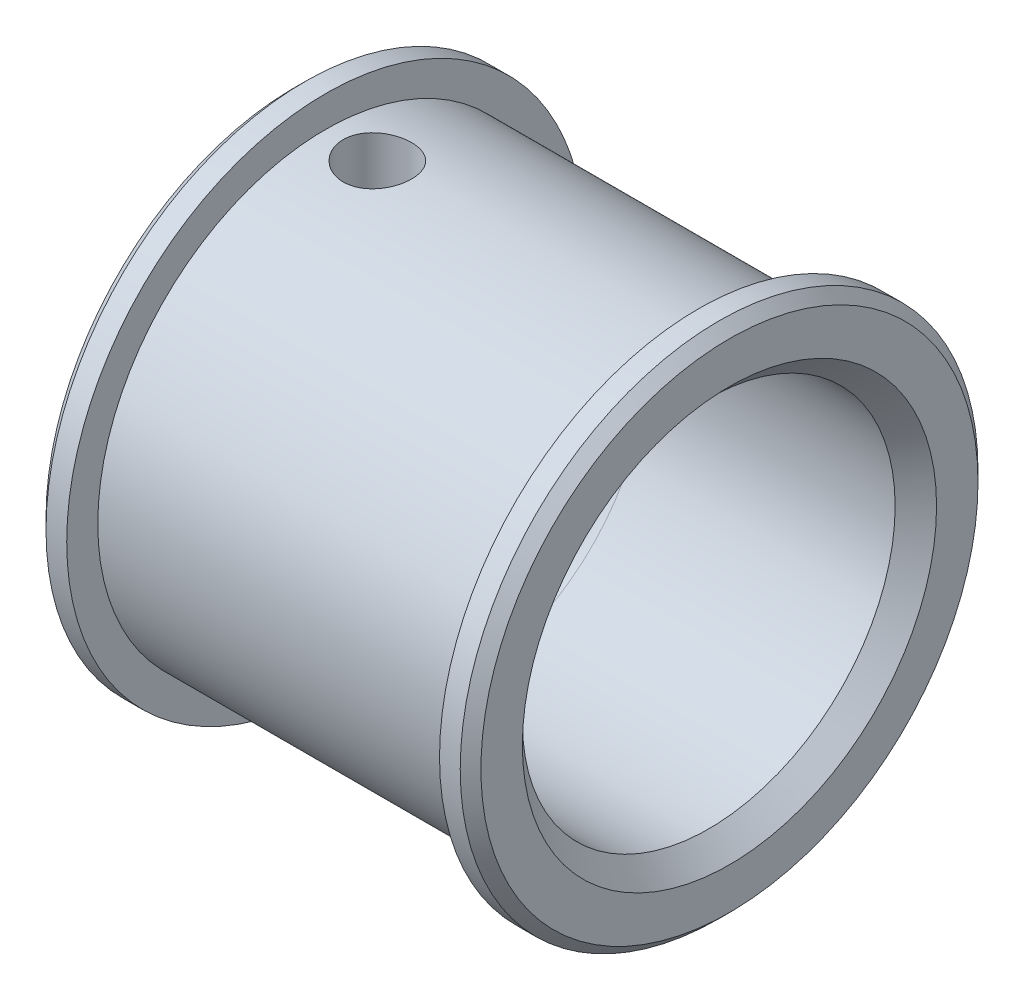
ISO-10303-21;
HEADER;
FILE_DESCRIPTION(('STEP AP214'),'2;1');
FILE_NAME('part.step','',(''),(''),'','','');
FILE_SCHEMA(('AUTOMOTIVE_DESIGN { 1 0 10303 214 1 1 1 1 }'));
ENDSEC;
DATA;
#1=APPLICATION_CONTEXT('core data for automotive mechanical design processes');
#2=APPLICATION_PROTOCOL_DEFINITION('international standard','automotive_design',2000,#1);
#3=PRODUCT_CONTEXT('',#1,'mechanical');
#4=PRODUCT('Part','Part','',(#3));
#5=PRODUCT_RELATED_PRODUCT_CATEGORY('part','',(#4));
#6=PRODUCT_DEFINITION_FORMATION('','',#4);
#7=PRODUCT_DEFINITION_CONTEXT('part definition',#1,'design');
#8=PRODUCT_DEFINITION('design','',#6,#7);
#9=PRODUCT_DEFINITION_SHAPE('','',#8);
#10=(LENGTH_UNIT() NAMED_UNIT(*) SI_UNIT(.MILLI.,.METRE.));
#11=(NAMED_UNIT(*) PLANE_ANGLE_UNIT() SI_UNIT($,.RADIAN.));
#12=(NAMED_UNIT(*) SI_UNIT($,.STERADIAN.) SOLID_ANGLE_UNIT());
#13=UNCERTAINTY_MEASURE_WITH_UNIT(LENGTH_MEASURE(1.E-05),#10,'distance_accuracy_value','');
#14=(GEOMETRIC_REPRESENTATION_CONTEXT(3) GLOBAL_UNCERTAINTY_ASSIGNED_CONTEXT((#13)) GLOBAL_UNIT_ASSIGNED_CONTEXT((#10,
#11,#12)) REPRESENTATION_CONTEXT('',''));
#15=CARTESIAN_POINT('',(0.,0.,0.));
#16=DIRECTION('',(0.,0.,1.));
#17=DIRECTION('',(1.,0.,0.));
#18=AXIS2_PLACEMENT_3D('',#15,#16,#17);
#19=CARTESIAN_POINT('',(10.5,0.,0.));
#20=DIRECTION('',(-1.,0.,0.));
#21=DIRECTION('',(0.,0.,1.));
#22=AXIS2_PLACEMENT_3D('',#19,#20,#21);
#23=CYLINDRICAL_SURFACE('',#22,12.5);
#24=CARTESIAN_POINT('',(10.,0.,0.));
#25=DIRECTION('',(1.,0.,0.));
#26=DIRECTION('',(0.,0.,-1.));
#27=AXIS2_PLACEMENT_3D('',#24,#25,#26);
#28=CIRCLE('',#27,12.5);
#29=CARTESIAN_POINT('',(10.,0.,-12.5));
#30=VERTEX_POINT('',#29);
#31=EDGE_CURVE('E165',#30,#30,#28,.F.);
#32=ORIENTED_EDGE('',*,*,#31,.T.);
#33=EDGE_LOOP('',(#32));
#34=FACE_BOUND('',#33,.T.);
#35=CARTESIAN_POINT('',(9.,0.,0.));
#36=DIRECTION('',(-1.,0.,0.));
#37=DIRECTION('',(0.,0.,1.));
#38=AXIS2_PLACEMENT_3D('',#35,#36,#37);
#39=CIRCLE('',#38,12.5);
#40=CARTESIAN_POINT('',(9.,0.,12.5));
#41=VERTEX_POINT('',#40);
#42=EDGE_CURVE('E118',#41,#41,#39,.T.);
#43=ORIENTED_EDGE('',*,*,#42,.F.);
#44=EDGE_LOOP('',(#43));
#45=FACE_BOUND('',#44,.T.);
#46=ADVANCED_FACE('F39',(#34,#45),#23,.T.);
#47=CARTESIAN_POINT('',(10.5,12.5,0.));
#48=DIRECTION('',(1.,0.,0.));
#49=DIRECTION('',(0.,0.,-1.));
#50=AXIS2_PLACEMENT_3D('',#47,#48,#49);
#51=PLANE('',#50);
#52=CARTESIAN_POINT('',(10.5,0.,0.));
#53=DIRECTION('',(1.,0.,0.));
#54=DIRECTION('',(0.,0.,-1.));
#55=AXIS2_PLACEMENT_3D('',#52,#53,#54);
#56=CIRCLE('',#55,10.);
#57=CARTESIAN_POINT('',(10.5,0.,-10.));
#58=VERTEX_POINT('',#57);
#59=EDGE_CURVE('E204',#58,#58,#56,.F.);
#60=ORIENTED_EDGE('',*,*,#59,.T.);
#61=EDGE_LOOP('',(#60));
#62=FACE_BOUND('',#61,.T.);
#63=CARTESIAN_POINT('',(10.5,0.,0.));
#64=DIRECTION('',(1.,0.,0.));
#65=DIRECTION('',(0.,0.,-1.));
#66=AXIS2_PLACEMENT_3D('',#63,#64,#65);
#67=CIRCLE('',#66,12.);
#68=CARTESIAN_POINT('',(10.5,0.,-12.));
#69=VERTEX_POINT('',#68);
#70=EDGE_CURVE('E195',#69,#69,#67,.T.);
#71=ORIENTED_EDGE('',*,*,#70,.T.);
#72=EDGE_LOOP('',(#71));
#73=FACE_BOUND('',#72,.T.);
#74=ADVANCED_FACE('F155',(#62,#73),#51,.T.);
#75=CARTESIAN_POINT('',(-10.5,0.,0.));
#76=DIRECTION('',(-1.,0.,0.));
#77=DIRECTION('',(0.,0.,1.));
#78=AXIS2_PLACEMENT_3D('',#75,#76,#77);
#79=PLANE('',#78);
#80=CARTESIAN_POINT('',(-10.5,0.,0.));
#81=DIRECTION('',(-1.,0.,0.));
#82=DIRECTION('',(0.,0.,1.));
#83=AXIS2_PLACEMENT_3D('',#80,#81,#82);
#84=CIRCLE('',#83,12.);
#85=CARTESIAN_POINT('',(-10.5,0.,12.));
#86=VERTEX_POINT('',#85);
#87=EDGE_CURVE('E72',#86,#86,#84,.T.);
#88=ORIENTED_EDGE('',*,*,#87,.T.);
#89=EDGE_LOOP('',(#88));
#90=FACE_BOUND('',#89,.T.);
#91=CARTESIAN_POINT('',(-10.5,0.,0.));
#92=DIRECTION('',(1.,0.,0.));
#93=DIRECTION('',(0.,0.,-1.));
#94=AXIS2_PLACEMENT_3D('',#91,#92,#93);
#95=CIRCLE('',#94,1.5);
#96=CARTESIAN_POINT('',(-10.5,0.,-1.5));
#97=VERTEX_POINT('',#96);
#98=EDGE_CURVE('E121',#97,#97,#95,.T.);
#99=ORIENTED_EDGE('',*,*,#98,.T.);
#100=EDGE_LOOP('',(#99));
#101=FACE_BOUND('',#100,.T.);
#102=ADVANCED_FACE('F160',(#90,#101),#79,.T.);
#103=CARTESIAN_POINT('',(10.5,0.,0.));
#104=DIRECTION('',(-1.,0.,0.));
#105=DIRECTION('',(0.,0.,1.));
#106=AXIS2_PLACEMENT_3D('',#103,#104,#105);
#107=CYLINDRICAL_SURFACE('',#106,12.5);
#108=CARTESIAN_POINT('',(-9.99999999999999,0.,0.));
#109=DIRECTION('',(-1.,0.,0.));
#110=DIRECTION('',(0.,0.,1.));
#111=AXIS2_PLACEMENT_3D('',#108,#109,#110);
#112=CIRCLE('',#111,12.5);
#113=CARTESIAN_POINT('',(-9.99999999999999,0.,12.5));
#114=VERTEX_POINT('',#113);
#115=EDGE_CURVE('E193',#114,#114,#112,.F.);
#116=ORIENTED_EDGE('',*,*,#115,.T.);
#117=EDGE_LOOP('',(#116));
#118=FACE_BOUND('',#117,.T.);
#119=CARTESIAN_POINT('',(-9.,0.,0.));
#120=DIRECTION('',(-1.,0.,0.));
#121=DIRECTION('',(0.,0.,1.));
#122=AXIS2_PLACEMENT_3D('',#119,#120,#121);
#123=CIRCLE('',#122,12.5);
#124=CARTESIAN_POINT('',(-9.,0.,12.5));
#125=VERTEX_POINT('',#124);
#126=EDGE_CURVE('E109',#125,#125,#123,.T.);
#127=ORIENTED_EDGE('',*,*,#126,.T.);
#128=EDGE_LOOP('',(#127));
#129=FACE_BOUND('',#128,.T.);
#130=ADVANCED_FACE('F180',(#118,#129),#107,.T.);
#131=CARTESIAN_POINT('',(-9.,12.5,0.));
#132=DIRECTION('',(1.,0.,0.));
#133=DIRECTION('',(0.,0.,-1.));
#134=AXIS2_PLACEMENT_3D('',#131,#132,#133);
#135=PLANE('',#134);
#136=CARTESIAN_POINT('',(-9.,0.,0.));
#137=DIRECTION('',(-1.,0.,0.));
#138=DIRECTION('',(0.,0.,1.));
#139=AXIS2_PLACEMENT_3D('',#136,#137,#138);
#140=CIRCLE('',#139,11.);
#141=CARTESIAN_POINT('',(-9.,0.,11.));
#142=VERTEX_POINT('',#141);
#143=EDGE_CURVE('E112',#142,#142,#140,.T.);
#144=ORIENTED_EDGE('',*,*,#143,.T.);
#145=EDGE_LOOP('',(#144));
#146=FACE_BOUND('',#145,.T.);
#147=ORIENTED_EDGE('',*,*,#126,.F.);
#148=EDGE_LOOP('',(#147));
#149=FACE_BOUND('',#148,.T.);
#150=ADVANCED_FACE('F174',(#146,#149),#135,.T.);
#151=CARTESIAN_POINT('',(10.5,0.,0.));
#152=DIRECTION('',(-1.,0.,0.));
#153=DIRECTION('',(0.,0.,1.));
#154=AXIS2_PLACEMENT_3D('',#151,#152,#153);
#155=CYLINDRICAL_SURFACE('',#154,11.);
#156=CARTESIAN_POINT('',(-6.5,10.8755459633069,1.64999999999999));
#157=CARTESIAN_POINT('',(-6.40787987378105,10.8755475033545,1.64999619518012));
#158=CARTESIAN_POINT('',(-6.31570627417422,10.8767290691301,1.64225926027339));
#159=CARTESIAN_POINT('',(-6.13393615362856,10.8813244628356,1.611524163227));
#160=CARTESIAN_POINT('',(-6.04434223537199,10.8847404680457,1.5885111154289));
#161=CARTESIAN_POINT('',(-5.87038886900841,10.8934093288485,1.52792778707892));
#162=CARTESIAN_POINT('',(-5.78602546120363,10.8986607744469,1.49036867849536));
#163=CARTESIAN_POINT('',(-5.62481026615071,10.9104071352446,1.4017856939657));
#164=CARTESIAN_POINT('',(-5.54795744676428,10.9169018792203,1.35076367172858));
#165=CARTESIAN_POINT('',(-5.40331780157024,10.9304611817284,1.23626692660414));
#166=CARTESIAN_POINT('',(-5.33559982525259,10.9375294870386,1.17270566143302));
#167=CARTESIAN_POINT('',(-5.21174876577896,10.9514060498595,1.03512156598881));
#168=CARTESIAN_POINT('',(-5.15561631961632,10.9582142930548,0.961098160865179));
#169=CARTESIAN_POINT('',(-5.05627570513951,10.97084282171,0.804249993858017));
#170=CARTESIAN_POINT('',(-5.0131309346453,10.9766582027913,0.721384650102341));
#171=CARTESIAN_POINT('',(-4.94139724131101,10.9866042742105,0.54948173511767));
#172=CARTESIAN_POINT('',(-4.91280754937283,10.9907350535614,0.460444490297743));
#173=CARTESIAN_POINT('',(-4.87120427261608,10.9968200627756,0.279434235399625));
#174=CARTESIAN_POINT('',(-4.85807540097413,10.9987903947608,0.187488272828852));
#175=CARTESIAN_POINT('',(-4.84740847169262,11.0003876924654,0.00267872442142739));
#176=CARTESIAN_POINT('',(-4.84986954734835,11.0000147884543,-0.0901848101173201));
#177=CARTESIAN_POINT('',(-4.87022167153868,10.9969804962687,-0.27340689002057));
#178=CARTESIAN_POINT('',(-4.88798868897064,10.9943375041773,-0.363779560540007));
#179=CARTESIAN_POINT('',(-4.93825366695484,10.9870805025064,-0.540246112057449));
#180=CARTESIAN_POINT('',(-4.97075200665159,10.9824664421971,-0.626339882864827));
#181=CARTESIAN_POINT('',(-5.04968409660881,10.9717541326053,-0.792180158847345));
#182=CARTESIAN_POINT('',(-5.09617006161962,10.965650338672,-0.871901439555953));
#183=CARTESIAN_POINT('',(-5.20171971303699,10.9526388206996,-1.02245869786519));
#184=CARTESIAN_POINT('',(-5.26078422737756,10.945731043755,-1.0932940900989));
#185=CARTESIAN_POINT('',(-5.39050529370925,10.9318017401189,-1.2247999309949));
#186=CARTESIAN_POINT('',(-5.46127013416713,10.9247797628558,-1.28536356246041));
#187=CARTESIAN_POINT('',(-5.61201518483611,10.9114797489888,-1.39377259272694));
#188=CARTESIAN_POINT('',(-5.69199545179192,10.9052017169661,-1.44161791320798));
#189=CARTESIAN_POINT('',(-5.85901235923471,10.8941005281554,-1.52324660988065));
#190=CARTESIAN_POINT('',(-5.94605444702863,10.8892785082982,-1.55701900497089));
#191=CARTESIAN_POINT('',(-6.12466378066213,10.8816554318897,-1.60943569829766));
#192=CARTESIAN_POINT('',(-6.21623070710143,10.8788542329093,-1.62808106271058));
#193=CARTESIAN_POINT('',(-6.40034009853524,10.8756169653453,-1.6495679209532));
#194=CARTESIAN_POINT('',(-6.49286450702169,10.8751582368283,-1.65256083591557));
#195=CARTESIAN_POINT('',(-6.67709361429907,10.8765976873087,-1.643059627218));
#196=CARTESIAN_POINT('',(-6.76879833843584,10.8784957931736,-1.63056598410532));
#197=CARTESIAN_POINT('',(-6.94831579976219,10.884414227076,-1.59057473248042));
#198=CARTESIAN_POINT('',(-7.03614572543576,10.8884238813114,-1.56315256380602));
#199=CARTESIAN_POINT('',(-7.20596250125346,10.8981048200834,-1.49416115141795));
#200=CARTESIAN_POINT('',(-7.28794906259101,10.9037761866789,-1.45259120904027));
#201=CARTESIAN_POINT('',(-7.44443058636854,10.9161949125577,-1.35612045794855));
#202=CARTESIAN_POINT('',(-7.51886449200779,10.9229500520799,-1.30112163017942));
#203=CARTESIAN_POINT('',(-7.65750014586119,10.9367517537669,-1.17949058520921));
#204=CARTESIAN_POINT('',(-7.72170131509926,10.9437983323932,-1.11285771019147));
#205=CARTESIAN_POINT('',(-7.83859286729694,10.9574597573913,-0.969183181590997));
#206=CARTESIAN_POINT('',(-7.89118290106672,10.9640705180647,-0.892059439449148));
#207=CARTESIAN_POINT('',(-7.9826601957889,10.9760519553522,-0.729984288290045));
#208=CARTESIAN_POINT('',(-8.02154783161152,10.9814226658902,-0.645033093496479));
#209=CARTESIAN_POINT('',(-8.08435611673683,10.9903009662687,-0.470027795447258));
#210=CARTESIAN_POINT('',(-8.10833163378619,10.9938153788969,-0.37999374462973));
#211=CARTESIAN_POINT('',(-8.14081266749121,10.9986137432259,-0.197120897051311));
#212=CARTESIAN_POINT('',(-8.14931920587405,10.9998978422388,-0.104282285943638));
#213=CARTESIAN_POINT('',(-8.15059587500434,11.0000894196506,0.0805910499469001));
#214=CARTESIAN_POINT('',(-8.14351954896467,10.9990200872618,0.172624727233257));
#215=CARTESIAN_POINT('',(-8.11416047273716,10.9946717157106,0.354177774855416));
#216=CARTESIAN_POINT('',(-8.09187777121058,10.9913926836193,0.443697153236163));
#217=CARTESIAN_POINT('',(-8.03279293687273,10.9829916541671,0.617638311817625));
#218=CARTESIAN_POINT('',(-7.99600143534717,10.9778710064864,0.702063772463658));
#219=CARTESIAN_POINT('',(-7.90895976321854,10.9663491794505,0.863567229686259));
#220=CARTESIAN_POINT('',(-7.85870915567162,10.9599479585237,0.940644987612776));
#221=CARTESIAN_POINT('',(-7.7456205312879,10.946501616998,1.08604384371115));
#222=CARTESIAN_POINT('',(-7.68266915160202,10.9394510326854,1.15427627309102));
#223=CARTESIAN_POINT('',(-7.54620441961148,10.925541018579,1.27926489229294));
#224=CARTESIAN_POINT('',(-7.47268859179322,10.9186816340392,1.33601838478882));
#225=CARTESIAN_POINT('',(-7.31669611844421,10.9058893243203,1.43672441905271));
#226=CARTESIAN_POINT('',(-7.23417144127598,10.8999618217268,1.48060323720329));
#227=CARTESIAN_POINT('',(-7.06287354556037,10.889768000218,1.55381175259249));
#228=CARTESIAN_POINT('',(-6.97410692135639,10.8854999583872,1.58315654832387));
#229=CARTESIAN_POINT('',(-6.82078482011787,10.8800943407731,1.61980447079028));
#230=CARTESIAN_POINT('',(-6.7571762633833,10.8783977432062,1.63111046758461));
#231=CARTESIAN_POINT('',(-6.62905387909221,10.8761230222371,1.64620951634231));
#232=CARTESIAN_POINT('',(-6.56454006328043,10.8755448843377,1.65000266568583));
#233=CARTESIAN_POINT('',(-6.5,10.8755459633069,1.64999999999999));
#234=B_SPLINE_CURVE_WITH_KNOTS('',3,(#156,#157,#158,#159,#160,#161,#162,#163,#164,#165,#166,
#167,#168,#169,#170,#171,#172,#173,#174,#175,#176,#177,#178,#179,#180,#181,#182,#183,#184,#185,
#186,#187,#188,#189,#190,#191,#192,#193,#194,#195,#196,#197,#198,#199,#200,#201,#202,#203,#204,
#205,#206,#207,#208,#209,#210,#211,#212,#213,#214,#215,#216,#217,#218,#219,#220,#221,#222,#223,
#224,#225,#226,#227,#228,#229,#230,#231,#232,#233),.UNSPECIFIED.,.T.,.F.,(4,2,2,2,2,2,2,2,2,2,2,
2,2,2,2,2,2,2,2,2,2,2,2,2,2,2,2,2,2,2,2,2,2,2,2,2,2,2,4),(0.,0.276124476985353,0.55251841651798,
0.828700493869239,1.10484456352745,1.38296574514018,1.66110221428598,1.94057514316359,
2.2200333030095,2.49739415787835,2.7747395933331,3.04985848767299,3.3249844632334,
3.60115048025097,3.87733468044198,4.15623499132894,4.43513701965783,4.7142562695045,
4.99335584488773,5.26975036064116,5.54613630009907,5.82113834288109,6.09615396814726,
6.3732403460143,6.65034239607979,6.92975291528865,7.20915578979037,7.48752444980196,
7.76587472287517,8.04149459984556,8.31711359482102,8.59253100483613,8.86795735723813,
9.14596045012062,9.42402879260544,9.7036596670742,9.98299943790115,10.1764568608077,
10.3699117761381),.UNSPECIFIED.);
#235=CARTESIAN_POINT('',(-6.5,10.8755459633069,1.64999999999999));
#236=VERTEX_POINT('',#235);
#237=EDGE_CURVE('E77',#236,#236,#234,.T.);
#238=ORIENTED_EDGE('',*,*,#237,.F.);
#239=EDGE_LOOP('',(#238));
#240=FACE_BOUND('',#239,.T.);
#241=CARTESIAN_POINT('',(9.,0.,0.));
#242=DIRECTION('',(-1.,0.,0.));
#243=DIRECTION('',(0.,0.,1.));
#244=AXIS2_PLACEMENT_3D('',#241,#242,#243);
#245=CIRCLE('',#244,11.);
#246=CARTESIAN_POINT('',(9.,0.,11.));
#247=VERTEX_POINT('',#246);
#248=EDGE_CURVE('E115',#247,#247,#245,.T.);
#249=ORIENTED_EDGE('',*,*,#248,.T.);
#250=EDGE_LOOP('',(#249));
#251=FACE_BOUND('',#250,.T.);
#252=ORIENTED_EDGE('',*,*,#143,.F.);
#253=EDGE_LOOP('',(#252));
#254=FACE_BOUND('',#253,.T.);
#255=ADVANCED_FACE('F133',(#240,#251,#254),#155,.T.);
#256=CARTESIAN_POINT('',(9.,11.,0.));
#257=DIRECTION('',(-1.,0.,0.));
#258=DIRECTION('',(0.,0.,1.));
#259=AXIS2_PLACEMENT_3D('',#256,#257,#258);
#260=PLANE('',#259);
#261=ORIENTED_EDGE('',*,*,#42,.T.);
#262=EDGE_LOOP('',(#261));
#263=FACE_BOUND('',#262,.T.);
#264=ORIENTED_EDGE('',*,*,#248,.F.);
#265=EDGE_LOOP('',(#264));
#266=FACE_BOUND('',#265,.T.);
#267=ADVANCED_FACE('F151',(#263,#266),#260,.T.);
#268=CARTESIAN_POINT('',(10.5,0.,0.));
#269=DIRECTION('',(1.,0.,0.));
#270=DIRECTION('',(0.,0.,-1.));
#271=AXIS2_PLACEMENT_3D('',#268,#269,#270);
#272=CYLINDRICAL_SURFACE('',#271,1.50000000000001);
#273=DIRECTION('',(1.,0.,0.));
#274=VECTOR('',#273,1.);
#275=CARTESIAN_POINT('',(10.5,0.,-1.50000000000001));
#276=LINE('',#275,#274);
#277=CARTESIAN_POINT('',(-5.81261364575665,0.,-1.50000000000001));
#278=VERTEX_POINT('',#277);
#279=CARTESIAN_POINT('',(-7.18738635424335,0.,-1.50000000000001));
#280=VERTEX_POINT('',#279);
#281=EDGE_CURVE('E73',#278,#280,#276,.F.);
#282=ORIENTED_EDGE('',*,*,#281,.T.);
#283=CARTESIAN_POINT('',(-7.18738635424335,0.,-1.50000000000001));
#284=CARTESIAN_POINT('',(-7.18736667555054,0.0221484449998914,-1.50000447406716));
#285=CARTESIAN_POINT('',(-7.18845783657937,0.0442761341413588,-1.49950927634109));
#286=CARTESIAN_POINT('',(-7.19268592309483,0.088230940756037,-1.49756294449903));
#287=CARTESIAN_POINT('',(-7.19581695700503,0.110058739556769,-1.49611456325326));
#288=CARTESIAN_POINT('',(-7.20786105987616,0.174065145863211,-1.49047328028753));
#289=CARTESIAN_POINT('',(-7.21943896893513,0.215631523118338,-1.48498052511109));
#290=CARTESIAN_POINT('',(-7.25475466598339,0.316953438714505,-1.46744293306415));
#291=CARTESIAN_POINT('',(-7.28168225412285,0.375195737109224,-1.45348605708139));
#292=CARTESIAN_POINT('',(-7.34135011584656,0.487494349877063,-1.41979888355068));
#293=CARTESIAN_POINT('',(-7.37415493945664,0.541493471462894,-1.40000270816457));
#294=CARTESIAN_POINT('',(-7.4381177934533,0.639336298720911,-1.35783883670072));
#295=CARTESIAN_POINT('',(-7.46900038503546,0.683620767198728,-1.33606556934906));
#296=CARTESIAN_POINT('',(-7.53140245086511,0.769517732585914,-1.28850839632406));
#297=CARTESIAN_POINT('',(-7.56292232917218,0.811128459664328,-1.26272187201679));
#298=CARTESIAN_POINT('',(-7.65683575303894,0.931855501150151,-1.17948671828247));
#299=CARTESIAN_POINT('',(-7.71886856717083,1.00727266753873,-1.11598629807276));
#300=CARTESIAN_POINT('',(-7.82178319800016,1.12931924692285,-0.990098916855109));
#301=CARTESIAN_POINT('',(-7.86410696518007,1.17846008304906,-0.931303964781125));
#302=CARTESIAN_POINT('',(-7.94270567343805,1.26861923064038,-0.804150695646672));
#303=CARTESIAN_POINT('',(-7.97898871101305,1.30964842834388,-0.735805408924688));
#304=CARTESIAN_POINT('',(-8.03652554955183,1.3742552315621,-0.60468801219247));
#305=CARTESIAN_POINT('',(-8.05933336587964,1.39968098658134,-0.543514926662859));
#306=CARTESIAN_POINT('',(-8.09798595778391,1.44261831335075,-0.416346887973427));
#307=CARTESIAN_POINT('',(-8.1138353391095,1.46013512020818,-0.350355158091539));
#308=CARTESIAN_POINT('',(-8.13742329587385,1.4861647140112,-0.214726616012657));
#309=CARTESIAN_POINT('',(-8.14511017436952,1.494620113907,-0.145069469232844));
#310=CARTESIAN_POINT('',(-8.15148252854544,1.50163145239621,-0.00485236427368442));
#311=CARTESIAN_POINT('',(-8.15017132346821,1.50019104138851,0.0657072514139764));
#312=CARTESIAN_POINT('',(-8.13927808616107,1.48819943697545,0.198055856544777));
#313=CARTESIAN_POINT('',(-8.13055149319627,1.47859051716962,0.260006547660193));
#314=CARTESIAN_POINT('',(-8.10659140763456,1.45212512243362,0.381012828513421));
#315=CARTESIAN_POINT('',(-8.0913566650431,1.43526725522268,0.440067859663005));
#316=CARTESIAN_POINT('',(-8.05441727854244,1.39420159043157,0.556985503150734));
#317=CARTESIAN_POINT('',(-8.03242842249822,1.36966981058904,0.614642568564462));
#318=CARTESIAN_POINT('',(-7.98351919413636,1.31471839277817,0.724782673881043));
#319=CARTESIAN_POINT('',(-7.95659681386782,1.28429635718164,0.77726359365904));
#320=CARTESIAN_POINT('',(-7.8837682243647,1.20121185017076,0.902985502421482));
#321=CARTESIAN_POINT('',(-7.83533038817184,1.14527327959721,0.972607311476638));
#322=CARTESIAN_POINT('',(-7.73322023416077,1.02439312474698,1.09923918777515));
#323=CARTESIAN_POINT('',(-7.67953093031201,0.959422018494189,1.1562062400392));
#324=CARTESIAN_POINT('',(-7.56912369000768,0.820030708328019,1.25906875302783));
#325=CARTESIAN_POINT('',(-7.51236390145752,0.74541985968592,1.30466286148348));
#326=CARTESIAN_POINT('',(-7.42996697828838,0.626989417453367,1.36338214886629));
#327=CARTESIAN_POINT('',(-7.40297098887716,0.586448311247508,1.38133684919242));
#328=CARTESIAN_POINT('',(-7.351027499075,0.502822395260114,1.41392509255887));
#329=CARTESIAN_POINT('',(-7.32607747419438,0.459740836545155,1.42856276901355));
#330=CARTESIAN_POINT('',(-7.28233561312036,0.375129278238263,1.45293241521924));
#331=CARTESIAN_POINT('',(-7.26317430090237,0.333895642009365,1.46301415456403));
#332=CARTESIAN_POINT('',(-7.23003809384318,0.248928057972154,1.47982745388689));
#333=CARTESIAN_POINT('',(-7.21602974940122,0.205212441634946,1.48658072104477));
#334=CARTESIAN_POINT('',(-7.19993003288422,0.134320181687064,1.49420358558966));
#335=CARTESIAN_POINT('',(-7.19530502795804,0.107861991820314,1.49635252195317));
#336=CARTESIAN_POINT('',(-7.1889971029343,0.0542883536749755,1.49926218434104));
#337=CARTESIAN_POINT('',(-7.18734082559878,0.0271691459158398,1.50001034175024));
#338=CARTESIAN_POINT('',(-7.18738635424334,0.,1.50000000000001));
#339=B_SPLINE_CURVE_WITH_KNOTS('',3,(#283,#284,#285,#286,#287,#288,#289,#290,#291,#292,#293,
#294,#295,#296,#297,#298,#299,#300,#301,#302,#303,#304,#305,#306,#307,#308,#309,#310,#311,#312,
#313,#314,#315,#316,#317,#318,#319,#320,#321,#322,#323,#324,#325,#326,#327,#328,#329,#330,#331,
#332,#333,#334,#335,#336,#337,#338),.UNSPECIFIED.,.F.,.F.,(4,2,2,2,2,2,2,2,2,2,2,2,2,2,2,2,2,2,
2,2,2,2,2,2,2,2,2,4),(0.,0.0663780026565314,0.132565136709904,0.262391568285189,
0.45831291266075,0.656535147557367,0.830949570164956,1.00547827832983,1.35297301132438,
1.61471771431488,1.87610872160456,2.0854642510003,2.29468099946103,2.50521505325033,
2.71567144872452,2.90470632319765,3.09377752118682,3.29225659457521,3.49081662935399,
3.79392731154882,4.09805305096363,4.40953989932394,4.56513131068289,4.72052775682222,
4.85993701945226,4.9984246574286,5.07906895311347,5.16043343232566),.UNSPECIFIED.);
#340=CARTESIAN_POINT('',(-7.18738635424335,0.,1.50000000000001));
#341=VERTEX_POINT('',#340);
#342=EDGE_CURVE('E65',#280,#341,#339,.T.);
#343=ORIENTED_EDGE('',*,*,#342,.T.);
#344=DIRECTION('',(1.,0.,0.));
#345=VECTOR('',#344,1.);
#346=CARTESIAN_POINT('',(10.5,0.,1.50000000000001));
#347=LINE('',#346,#345);
#348=CARTESIAN_POINT('',(-5.81261364575666,0.,1.50000000000001));
#349=VERTEX_POINT('',#348);
#350=EDGE_CURVE('E81',#341,#349,#347,.T.);
#351=ORIENTED_EDGE('',*,*,#350,.T.);
#352=CARTESIAN_POINT('',(-5.81261364575666,0.,1.50000000000001));
#353=CARTESIAN_POINT('',(-5.81263332444947,0.0221484449998913,1.50000447406716));
#354=CARTESIAN_POINT('',(-5.81154216342064,0.0442761341413587,1.49950927634109));
#355=CARTESIAN_POINT('',(-5.80731407690517,0.0882309407560367,1.49756294449903));
#356=CARTESIAN_POINT('',(-5.80418304299497,0.110058739556768,1.49611456325326));
#357=CARTESIAN_POINT('',(-5.79213894012385,0.17406514586321,1.49047328028753));
#358=CARTESIAN_POINT('',(-5.78056103106487,0.215631523118337,1.48498052511109));
#359=CARTESIAN_POINT('',(-5.74524533401662,0.316953438714504,1.46744293306415));
#360=CARTESIAN_POINT('',(-5.71831774587715,0.375195737109223,1.45348605708139));
#361=CARTESIAN_POINT('',(-5.65864988415344,0.487494349877061,1.41979888355068));
#362=CARTESIAN_POINT('',(-5.62584506054336,0.541493471462893,1.40000270816457));
#363=CARTESIAN_POINT('',(-5.56188220654671,0.639336298720909,1.35783883670073));
#364=CARTESIAN_POINT('',(-5.53099961496455,0.683620767198726,1.33606556934906));
#365=CARTESIAN_POINT('',(-5.46859754913489,0.769517732585911,1.28850839632406));
#366=CARTESIAN_POINT('',(-5.43707767082782,0.811128459664326,1.26272187201679));
#367=CARTESIAN_POINT('',(-5.34316424696106,0.93185550115015,1.17948671828248));
#368=CARTESIAN_POINT('',(-5.28113143282917,1.00727266753873,1.11598629807276));
#369=CARTESIAN_POINT('',(-5.17821680199984,1.12931924692285,0.990098916855111));
#370=CARTESIAN_POINT('',(-5.13589303481993,1.17846008304906,0.931303964781127));
#371=CARTESIAN_POINT('',(-5.05729432656195,1.26861923064038,0.804150695646674));
#372=CARTESIAN_POINT('',(-5.02101128898696,1.30964842834388,0.73580540892469));
#373=CARTESIAN_POINT('',(-4.96347445044817,1.3742552315621,0.604688012192471));
#374=CARTESIAN_POINT('',(-4.94066663412036,1.39968098658134,0.543514926662861));
#375=CARTESIAN_POINT('',(-4.90201404221609,1.44261831335075,0.416346887973428));
#376=CARTESIAN_POINT('',(-4.8861646608905,1.46013512020818,0.35035515809154));
#377=CARTESIAN_POINT('',(-4.86257670412615,1.4861647140112,0.214726616012658));
#378=CARTESIAN_POINT('',(-4.85488982563048,1.494620113907,0.145069469232845));
#379=CARTESIAN_POINT('',(-4.84851747145456,1.50163145239621,0.00485236427368556));
#380=CARTESIAN_POINT('',(-4.84982867653179,1.50019104138851,-0.0657072514139752));
#381=CARTESIAN_POINT('',(-4.86072191383893,1.48819943697545,-0.198055856544776));
#382=CARTESIAN_POINT('',(-4.86944850680373,1.47859051716962,-0.260006547660193));
#383=CARTESIAN_POINT('',(-4.89340859236544,1.45212512243362,-0.381012828513421));
#384=CARTESIAN_POINT('',(-4.9086433349569,1.43526725522268,-0.440067859663005));
#385=CARTESIAN_POINT('',(-4.94558272145756,1.39420159043157,-0.556985503150733));
#386=CARTESIAN_POINT('',(-4.96757157750178,1.36966981058904,-0.614642568564461));
#387=CARTESIAN_POINT('',(-5.01648080586364,1.31471839277817,-0.724782673881041));
#388=CARTESIAN_POINT('',(-5.04340318613218,1.28429635718164,-0.777263593659039));
#389=CARTESIAN_POINT('',(-5.1162317756353,1.20121185017076,-0.902985502421481));
#390=CARTESIAN_POINT('',(-5.16466961182815,1.14527327959721,-0.972607311476637));
#391=CARTESIAN_POINT('',(-5.26677976583923,1.02439312474698,-1.09923918777515));
#392=CARTESIAN_POINT('',(-5.32046906968799,0.959422018494191,-1.1562062400392));
#393=CARTESIAN_POINT('',(-5.43087630999231,0.820030708328021,-1.25906875302783));
#394=CARTESIAN_POINT('',(-5.48763609854248,0.745419859685922,-1.30466286148348));
#395=CARTESIAN_POINT('',(-5.57003302171162,0.626989417453368,-1.36338214886629));
#396=CARTESIAN_POINT('',(-5.59702901112283,0.58644831124751,-1.38133684919242));
#397=CARTESIAN_POINT('',(-5.64897250092499,0.502822395260115,-1.41392509255887));
#398=CARTESIAN_POINT('',(-5.67392252580562,0.459740836545157,-1.42856276901355));
#399=CARTESIAN_POINT('',(-5.71766438687964,0.375129278238266,-1.45293241521924));
#400=CARTESIAN_POINT('',(-5.73682569909763,0.333895642009367,-1.46301415456403));
#401=CARTESIAN_POINT('',(-5.76996190615681,0.248928057972156,-1.47982745388689));
#402=CARTESIAN_POINT('',(-5.78397025059878,0.205212441634948,-1.48658072104477));
#403=CARTESIAN_POINT('',(-5.80006996711577,0.134320181687065,-1.49420358558966));
#404=CARTESIAN_POINT('',(-5.80469497204196,0.107861991820315,-1.49635252195317));
#405=CARTESIAN_POINT('',(-5.8110028970657,0.054288353674976,-1.49926218434104));
#406=CARTESIAN_POINT('',(-5.81265917440121,0.0271691459158401,-1.50001034175024));
#407=CARTESIAN_POINT('',(-5.81261364575665,0.,-1.50000000000001));
#408=B_SPLINE_CURVE_WITH_KNOTS('',3,(#352,#353,#354,#355,#356,#357,#358,#359,#360,#361,#362,
#363,#364,#365,#366,#367,#368,#369,#370,#371,#372,#373,#374,#375,#376,#377,#378,#379,#380,#381,
#382,#383,#384,#385,#386,#387,#388,#389,#390,#391,#392,#393,#394,#395,#396,#397,#398,#399,#400,
#401,#402,#403,#404,#405,#406,#407),.UNSPECIFIED.,.F.,.F.,(4,2,2,2,2,2,2,2,2,2,2,2,2,2,2,2,2,2,
2,2,2,2,2,2,2,2,2,4),(0.,0.0663780026565313,0.132565136709904,0.262391568285188,
0.45831291266075,0.656535147557365,0.830949570164952,1.00547827832983,1.35297301132437,
1.61471771431488,1.87610872160456,2.0854642510003,2.29468099946103,2.50521505325033,
2.71567144872452,2.90470632319765,3.09377752118682,3.29225659457521,3.49081662935399,
3.79392731154881,4.09805305096363,4.40953989932394,4.56513131068289,4.72052775682221,
4.85993701945225,4.9984246574286,5.07906895311347,5.16043343232566),.UNSPECIFIED.);
#409=EDGE_CURVE('E60',#349,#278,#408,.T.);
#410=ORIENTED_EDGE('',*,*,#409,.T.);
#411=EDGE_LOOP('',(#282,#343,#351,#410));
#412=FACE_BOUND('',#411,.T.);
#413=ORIENTED_EDGE('',*,*,#98,.F.);
#414=EDGE_LOOP('',(#413));
#415=FACE_BOUND('',#414,.T.);
#416=CARTESIAN_POINT('',(-3.5,0.,0.));
#417=DIRECTION('',(1.,0.,0.));
#418=DIRECTION('',(0.,0.,-1.));
#419=AXIS2_PLACEMENT_3D('',#416,#417,#418);
#420=CIRCLE('',#419,1.50000000000001);
#421=CARTESIAN_POINT('',(-3.5,0.,-1.50000000000001));
#422=VERTEX_POINT('',#421);
#423=EDGE_CURVE('E124',#422,#422,#420,.T.);
#424=ORIENTED_EDGE('',*,*,#423,.T.);
#425=EDGE_LOOP('',(#424));
#426=FACE_BOUND('',#425,.T.);
#427=ADVANCED_FACE('F79',(#412,#415,#426),#272,.F.);
#428=CARTESIAN_POINT('',(-3.5,1.50000000000001,0.));
#429=DIRECTION('',(-1.,0.,0.));
#430=DIRECTION('',(0.,0.,1.));
#431=AXIS2_PLACEMENT_3D('',#428,#429,#430);
#432=PLANE('',#431);
#433=CARTESIAN_POINT('',(-3.5,0.,0.));
#434=DIRECTION('',(-1.,0.,0.));
#435=DIRECTION('',(0.,0.,1.));
#436=AXIS2_PLACEMENT_3D('',#433,#434,#435);
#437=CIRCLE('',#436,7.99999999999999);
#438=CARTESIAN_POINT('',(-3.5,0.,7.99999999999999));
#439=VERTEX_POINT('',#438);
#440=EDGE_CURVE('E47',#439,#439,#437,.F.);
#441=ORIENTED_EDGE('',*,*,#440,.T.);
#442=EDGE_LOOP('',(#441));
#443=FACE_BOUND('',#442,.T.);
#444=ORIENTED_EDGE('',*,*,#423,.F.);
#445=EDGE_LOOP('',(#444));
#446=FACE_BOUND('',#445,.T.);
#447=ADVANCED_FACE('F144',(#443,#446),#432,.F.);
#448=CARTESIAN_POINT('',(10.5,0.,0.));
#449=DIRECTION('',(1.,0.,0.));
#450=DIRECTION('',(0.,0.,-1.));
#451=AXIS2_PLACEMENT_3D('',#448,#449,#450);
#452=CYLINDRICAL_SURFACE('',#451,8.99999999999999);
#453=CARTESIAN_POINT('',(-2.5,0.,0.));
#454=DIRECTION('',(-1.,0.,0.));
#455=DIRECTION('',(0.,0.,1.));
#456=AXIS2_PLACEMENT_3D('',#453,#454,#455);
#457=CIRCLE('',#456,8.99999999999999);
#458=CARTESIAN_POINT('',(-2.5,0.,8.99999999999999));
#459=VERTEX_POINT('',#458);
#460=EDGE_CURVE('E11',#459,#459,#457,.T.);
#461=ORIENTED_EDGE('',*,*,#460,.T.);
#462=EDGE_LOOP('',(#461));
#463=FACE_BOUND('',#462,.T.);
#464=CARTESIAN_POINT('',(9.5,0.,0.));
#465=DIRECTION('',(1.,0.,0.));
#466=DIRECTION('',(0.,0.,-1.));
#467=AXIS2_PLACEMENT_3D('',#464,#465,#466);
#468=CIRCLE('',#467,8.99999999999999);
#469=CARTESIAN_POINT('',(9.5,0.,-8.99999999999999));
#470=VERTEX_POINT('',#469);
#471=EDGE_CURVE('E201',#470,#470,#468,.T.);
#472=ORIENTED_EDGE('',*,*,#471,.T.);
#473=EDGE_LOOP('',(#472));
#474=FACE_BOUND('',#473,.T.);
#475=ADVANCED_FACE('F142',(#463,#474),#452,.F.);
#476=CARTESIAN_POINT('',(-6.5,0.,0.));
#477=DIRECTION('',(0.,-1.,0.));
#478=DIRECTION('',(0.,0.,-1.));
#479=AXIS2_PLACEMENT_3D('',#476,#477,#478);
#480=PLANE('',#479);
#481=CARTESIAN_POINT('',(-6.5,0.,0.));
#482=DIRECTION('',(0.,1.,0.));
#483=DIRECTION('',(0.,0.,1.));
#484=AXIS2_PLACEMENT_3D('',#481,#482,#483);
#485=CIRCLE('',#484,1.65);
#486=EDGE_CURVE('E68',#278,#280,#485,.T.);
#487=ORIENTED_EDGE('',*,*,#486,.T.);
#488=ORIENTED_EDGE('',*,*,#281,.F.);
#489=EDGE_LOOP('',(#487,#488));
#490=FACE_BOUND('',#489,.T.);
#491=ADVANCED_FACE('F76',(#490),#480,.F.);
#492=EDGE_CURVE('E54',#341,#349,#485,.T.);
#493=ORIENTED_EDGE('',*,*,#492,.T.);
#494=ORIENTED_EDGE('',*,*,#350,.F.);
#495=EDGE_LOOP('',(#493,#494));
#496=FACE_BOUND('',#495,.T.);
#497=ADVANCED_FACE('F140',(#496),#480,.F.);
#498=CARTESIAN_POINT('',(-6.5,11.,0.));
#499=DIRECTION('',(0.,1.,0.));
#500=DIRECTION('',(0.,0.,1.));
#501=AXIS2_PLACEMENT_3D('',#498,#499,#500);
#502=CYLINDRICAL_SURFACE('',#501,1.64999999999999);
#503=ORIENTED_EDGE('',*,*,#237,.T.);
#504=EDGE_LOOP('',(#503));
#505=FACE_BOUND('',#504,.T.);
#506=ORIENTED_EDGE('',*,*,#486,.F.);
#507=ORIENTED_EDGE('',*,*,#409,.F.);
#508=ORIENTED_EDGE('',*,*,#492,.F.);
#509=ORIENTED_EDGE('',*,*,#342,.F.);
#510=EDGE_LOOP('',(#506,#507,#508,#509));
#511=FACE_BOUND('',#510,.T.);
#512=ADVANCED_FACE('F67',(#505,#511),#502,.F.);
#513=CARTESIAN_POINT('',(-10.5,0.,0.));
#514=DIRECTION('',(1.,0.,0.));
#515=DIRECTION('',(0.,0.,-1.));
#516=AXIS2_PLACEMENT_3D('',#513,#514,#515);
#517=CONICAL_SURFACE('',#516,12.,0.785398163397443);
#518=ORIENTED_EDGE('',*,*,#115,.F.);
#519=EDGE_LOOP('',(#518));
#520=FACE_BOUND('',#519,.T.);
#521=ORIENTED_EDGE('',*,*,#87,.F.);
#522=EDGE_LOOP('',(#521));
#523=FACE_BOUND('',#522,.T.);
#524=ADVANCED_FACE('F101',(#520,#523),#517,.T.);
#525=CARTESIAN_POINT('',(10.,0.,0.));
#526=DIRECTION('',(-1.,0.,0.));
#527=DIRECTION('',(0.,0.,1.));
#528=AXIS2_PLACEMENT_3D('',#525,#526,#527);
#529=CONICAL_SURFACE('',#528,12.5,0.78539816339745);
#530=ORIENTED_EDGE('',*,*,#70,.F.);
#531=EDGE_LOOP('',(#530));
#532=FACE_BOUND('',#531,.T.);
#533=ORIENTED_EDGE('',*,*,#31,.F.);
#534=EDGE_LOOP('',(#533));
#535=FACE_BOUND('',#534,.T.);
#536=ADVANCED_FACE('F214',(#532,#535),#529,.T.);
#537=CARTESIAN_POINT('',(9.5,0.,0.));
#538=DIRECTION('',(1.,0.,0.));
#539=DIRECTION('',(0.,0.,-1.));
#540=AXIS2_PLACEMENT_3D('',#537,#538,#539);
#541=CONICAL_SURFACE('',#540,8.99999999999999,0.785398163397451);
#542=ORIENTED_EDGE('',*,*,#59,.F.);
#543=EDGE_LOOP('',(#542));
#544=FACE_BOUND('',#543,.T.);
#545=ORIENTED_EDGE('',*,*,#471,.F.);
#546=EDGE_LOOP('',(#545));
#547=FACE_BOUND('',#546,.T.);
#548=ADVANCED_FACE('F209',(#544,#547),#541,.F.);
#549=CARTESIAN_POINT('',(-2.5,0.,0.));
#550=DIRECTION('',(-1.,0.,0.));
#551=DIRECTION('',(0.,0.,1.));
#552=AXIS2_PLACEMENT_3D('',#549,#550,#551);
#553=TOROIDAL_SURFACE('',#552,7.99999999999999,1.);
#554=ORIENTED_EDGE('',*,*,#460,.F.);
#555=EDGE_LOOP('',(#554));
#556=FACE_BOUND('',#555,.T.);
#557=ORIENTED_EDGE('',*,*,#440,.F.);
#558=EDGE_LOOP('',(#557));
#559=FACE_BOUND('',#558,.T.);
#560=ADVANCED_FACE('F41',(#556,#559),#553,.F.);
#561=CLOSED_SHELL('',(#46,#74,#102,#130,#150,#255,#267,#427,#447,#475,#491,#497,#512,#524,#536,
#548,#560));
#562=MANIFOLD_SOLID_BREP('B2',#561);
#563=ADVANCED_BREP_SHAPE_REPRESENTATION('',(#18,#562),#14);
#564=SHAPE_DEFINITION_REPRESENTATION(#9,#563);
ENDSEC;
END-ISO-10303-21;
